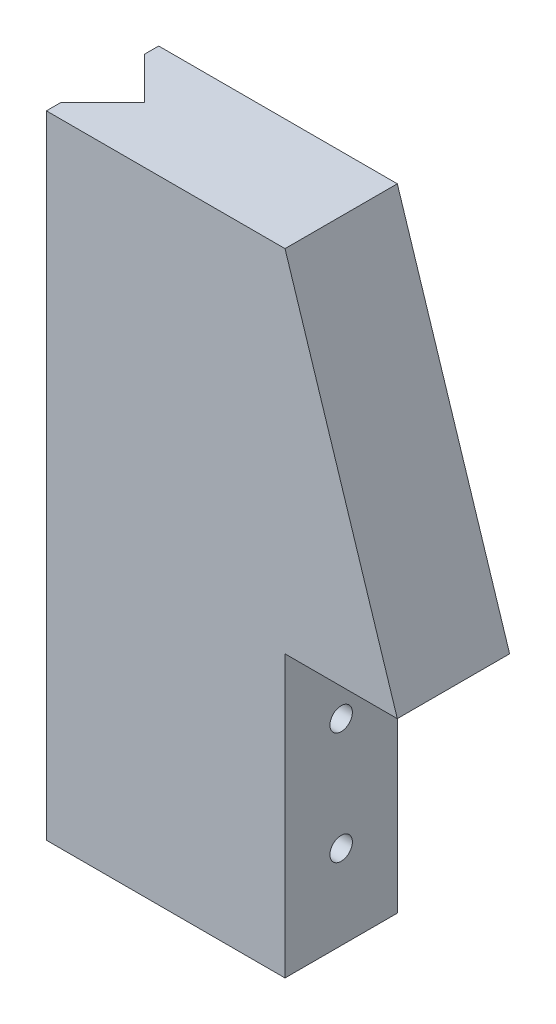
ISO-10303-21;
HEADER;
FILE_DESCRIPTION(('STEP AP214'),'2;1');
FILE_NAME('part.step','',(''),(''),'','','');
FILE_SCHEMA(('AUTOMOTIVE_DESIGN { 1 0 10303 214 1 1 1 1 }'));
ENDSEC;
DATA;
#1=APPLICATION_CONTEXT('core data for automotive mechanical design processes');
#2=APPLICATION_PROTOCOL_DEFINITION('international standard','automotive_design',2000,#1);
#3=PRODUCT_CONTEXT('',#1,'mechanical');
#4=PRODUCT('Part','Part','',(#3));
#5=PRODUCT_RELATED_PRODUCT_CATEGORY('part','',(#4));
#6=PRODUCT_DEFINITION_FORMATION('','',#4);
#7=PRODUCT_DEFINITION_CONTEXT('part definition',#1,'design');
#8=PRODUCT_DEFINITION('design','',#6,#7);
#9=PRODUCT_DEFINITION_SHAPE('','',#8);
#10=(LENGTH_UNIT() NAMED_UNIT(*) SI_UNIT(.MILLI.,.METRE.));
#11=(NAMED_UNIT(*) PLANE_ANGLE_UNIT() SI_UNIT($,.RADIAN.));
#12=(NAMED_UNIT(*) SI_UNIT($,.STERADIAN.) SOLID_ANGLE_UNIT());
#13=UNCERTAINTY_MEASURE_WITH_UNIT(LENGTH_MEASURE(1.E-05),#10,'distance_accuracy_value','');
#14=(GEOMETRIC_REPRESENTATION_CONTEXT(3) GLOBAL_UNCERTAINTY_ASSIGNED_CONTEXT((#13)) GLOBAL_UNIT_ASSIGNED_CONTEXT((#10,
#11,#12)) REPRESENTATION_CONTEXT('',''));
#15=CARTESIAN_POINT('',(0.,0.,0.));
#16=DIRECTION('',(0.,0.,1.));
#17=DIRECTION('',(1.,0.,0.));
#18=AXIS2_PLACEMENT_3D('',#15,#16,#17);
#19=CARTESIAN_POINT('',(-25.,-20.,8.));
#20=DIRECTION('',(1.,0.,0.));
#21=DIRECTION('',(0.,0.,-1.));
#22=AXIS2_PLACEMENT_3D('',#19,#20,#21);
#23=PLANE('',#22);
#24=DIRECTION('',(0.,0.,-1.));
#25=VECTOR('',#24,1.);
#26=CARTESIAN_POINT('',(-25.,-20.,8.));
#27=LINE('',#26,#25);
#28=CARTESIAN_POINT('',(-25.,-20.,1.));
#29=VERTEX_POINT('',#28);
#30=CARTESIAN_POINT('',(-25.,-20.,0.));
#31=VERTEX_POINT('',#30);
#32=EDGE_CURVE('E128',#29,#31,#27,.T.);
#33=ORIENTED_EDGE('',*,*,#32,.F.);
#34=DIRECTION('',(0.,1.,0.));
#35=VECTOR('',#34,1.);
#36=CARTESIAN_POINT('',(-25.,-20.,1.));
#37=LINE('',#36,#35);
#38=CARTESIAN_POINT('',(-25.,25.,1.));
#39=VERTEX_POINT('',#38);
#40=EDGE_CURVE('E141',#29,#39,#37,.T.);
#41=ORIENTED_EDGE('',*,*,#40,.T.);
#42=DIRECTION('',(0.,0.,-1.));
#43=VECTOR('',#42,1.);
#44=CARTESIAN_POINT('',(-25.,25.,8.));
#45=LINE('',#44,#43);
#46=CARTESIAN_POINT('',(-25.,25.,0.));
#47=VERTEX_POINT('',#46);
#48=EDGE_CURVE('E155',#39,#47,#45,.T.);
#49=ORIENTED_EDGE('',*,*,#48,.T.);
#50=DIRECTION('',(0.,-1.,0.));
#51=VECTOR('',#50,1.);
#52=CARTESIAN_POINT('',(-25.,-20.,0.));
#53=LINE('',#52,#51);
#54=EDGE_CURVE('E144',#47,#31,#53,.T.);
#55=ORIENTED_EDGE('',*,*,#54,.T.);
#56=EDGE_LOOP('',(#33,#41,#49,#55));
#57=FACE_BOUND('',#56,.T.);
#58=ADVANCED_FACE('F39',(#57),#23,.F.);
#59=CARTESIAN_POINT('',(-8.,25.,8.));
#60=DIRECTION('',(-0.952424147199324,-0.304775727103784,0.));
#61=DIRECTION('',(0.304775727103784,-0.952424147199324,0.));
#62=AXIS2_PLACEMENT_3D('',#59,#60,#61);
#63=PLANE('',#62);
#64=DIRECTION('',(-0.304775727103784,0.952424147199324,0.));
#65=VECTOR('',#64,1.);
#66=CARTESIAN_POINT('',(-8.,25.,0.));
#67=LINE('',#66,#65);
#68=CARTESIAN_POINT('',(0.,0.,0.));
#69=VERTEX_POINT('',#68);
#70=CARTESIAN_POINT('',(-8.,25.,0.));
#71=VERTEX_POINT('',#70);
#72=EDGE_CURVE('E137',#69,#71,#67,.T.);
#73=ORIENTED_EDGE('',*,*,#72,.T.);
#74=DIRECTION('',(0.,0.,-1.));
#75=VECTOR('',#74,1.);
#76=CARTESIAN_POINT('',(-8.,25.,8.));
#77=LINE('',#76,#75);
#78=CARTESIAN_POINT('',(-8.,25.,8.));
#79=VERTEX_POINT('',#78);
#80=EDGE_CURVE('E11',#79,#71,#77,.T.);
#81=ORIENTED_EDGE('',*,*,#80,.F.);
#82=DIRECTION('',(-0.304775727103784,0.952424147199324,0.));
#83=VECTOR('',#82,1.);
#84=CARTESIAN_POINT('',(-8.,25.,8.));
#85=LINE('',#84,#83);
#86=CARTESIAN_POINT('',(0.,0.,8.));
#87=VERTEX_POINT('',#86);
#88=EDGE_CURVE('E151',#87,#79,#85,.T.);
#89=ORIENTED_EDGE('',*,*,#88,.F.);
#90=DIRECTION('',(0.,0.,-1.));
#91=VECTOR('',#90,1.);
#92=CARTESIAN_POINT('',(0.,0.,8.));
#93=LINE('',#92,#91);
#94=EDGE_CURVE('E133',#87,#69,#93,.T.);
#95=ORIENTED_EDGE('',*,*,#94,.T.);
#96=EDGE_LOOP('',(#73,#81,#89,#95));
#97=FACE_BOUND('',#96,.T.);
#98=ADVANCED_FACE('F41',(#97),#63,.F.);
#99=CARTESIAN_POINT('',(-25.,25.,8.));
#100=DIRECTION('',(0.,-1.,0.));
#101=DIRECTION('',(1.,0.,0.));
#102=AXIS2_PLACEMENT_3D('',#99,#100,#101);
#103=PLANE('',#102);
#104=ORIENTED_EDGE('',*,*,#48,.F.);
#105=DIRECTION('',(-0.707106781186546,0.,-0.707106781186549));
#106=VECTOR('',#105,1.);
#107=CARTESIAN_POINT('',(-22.,25.,4.));
#108=LINE('',#107,#106);
#109=CARTESIAN_POINT('',(-22.,25.,4.));
#110=VERTEX_POINT('',#109);
#111=EDGE_CURVE('E183',#110,#39,#108,.T.);
#112=ORIENTED_EDGE('',*,*,#111,.F.);
#113=DIRECTION('',(0.707106781186546,0.,-0.707106781186549));
#114=VECTOR('',#113,1.);
#115=CARTESIAN_POINT('',(-25.,25.,7.));
#116=LINE('',#115,#114);
#117=CARTESIAN_POINT('',(-25.,25.,7.));
#118=VERTEX_POINT('',#117);
#119=EDGE_CURVE('E187',#118,#110,#116,.T.);
#120=ORIENTED_EDGE('',*,*,#119,.F.);
#121=CARTESIAN_POINT('',(-25.,25.,8.));
#122=VERTEX_POINT('',#121);
#123=EDGE_CURVE('E47',#122,#118,#45,.T.);
#124=ORIENTED_EDGE('',*,*,#123,.F.);
#125=DIRECTION('',(-1.,0.,0.));
#126=VECTOR('',#125,1.);
#127=CARTESIAN_POINT('',(-25.,25.,8.));
#128=LINE('',#127,#126);
#129=EDGE_CURVE('E98',#79,#122,#128,.T.);
#130=ORIENTED_EDGE('',*,*,#129,.F.);
#131=ORIENTED_EDGE('',*,*,#80,.T.);
#132=DIRECTION('',(-1.,0.,0.));
#133=VECTOR('',#132,1.);
#134=CARTESIAN_POINT('',(-25.,25.,0.));
#135=LINE('',#134,#133);
#136=EDGE_CURVE('E140',#71,#47,#135,.T.);
#137=ORIENTED_EDGE('',*,*,#136,.T.);
#138=EDGE_LOOP('',(#104,#112,#120,#124,#130,#131,#137));
#139=FACE_BOUND('',#138,.T.);
#140=ADVANCED_FACE('F166',(#139),#103,.F.);
#141=ORIENTED_EDGE('',*,*,#123,.T.);
#142=DIRECTION('',(0.,1.,0.));
#143=VECTOR('',#142,1.);
#144=CARTESIAN_POINT('',(-25.,-20.,7.));
#145=LINE('',#144,#143);
#146=CARTESIAN_POINT('',(-25.,-20.,7.));
#147=VERTEX_POINT('',#146);
#148=EDGE_CURVE('E177',#147,#118,#145,.T.);
#149=ORIENTED_EDGE('',*,*,#148,.F.);
#150=CARTESIAN_POINT('',(-25.,-20.,8.));
#151=VERTEX_POINT('',#150);
#152=EDGE_CURVE('E154',#151,#147,#27,.T.);
#153=ORIENTED_EDGE('',*,*,#152,.F.);
#154=DIRECTION('',(0.,-1.,0.));
#155=VECTOR('',#154,1.);
#156=CARTESIAN_POINT('',(-25.,-20.,8.));
#157=LINE('',#156,#155);
#158=EDGE_CURVE('E115',#122,#151,#157,.T.);
#159=ORIENTED_EDGE('',*,*,#158,.F.);
#160=EDGE_LOOP('',(#141,#149,#153,#159));
#161=FACE_BOUND('',#160,.T.);
#162=ADVANCED_FACE('F230',(#161),#23,.F.);
#163=CARTESIAN_POINT('',(-8.,-20.,8.));
#164=DIRECTION('',(0.,1.,0.));
#165=DIRECTION('',(0.,0.,1.));
#166=AXIS2_PLACEMENT_3D('',#163,#164,#165);
#167=PLANE('',#166);
#168=DIRECTION('',(0.707106781186546,0.,-0.707106781186549));
#169=VECTOR('',#168,1.);
#170=CARTESIAN_POINT('',(-25.,-20.,7.));
#171=LINE('',#170,#169);
#172=CARTESIAN_POINT('',(-22.,-20.,4.));
#173=VERTEX_POINT('',#172);
#174=EDGE_CURVE('E186',#147,#173,#171,.T.);
#175=ORIENTED_EDGE('',*,*,#174,.T.);
#176=DIRECTION('',(-0.707106781186546,0.,-0.707106781186549));
#177=VECTOR('',#176,1.);
#178=CARTESIAN_POINT('',(-22.,-20.,4.));
#179=LINE('',#178,#177);
#180=EDGE_CURVE('E54',#173,#29,#179,.T.);
#181=ORIENTED_EDGE('',*,*,#180,.T.);
#182=ORIENTED_EDGE('',*,*,#32,.T.);
#183=DIRECTION('',(1.,0.,0.));
#184=VECTOR('',#183,1.);
#185=CARTESIAN_POINT('',(-8.,-20.,0.));
#186=LINE('',#185,#184);
#187=CARTESIAN_POINT('',(-8.,-20.,0.));
#188=VERTEX_POINT('',#187);
#189=EDGE_CURVE('E125',#31,#188,#186,.T.);
#190=ORIENTED_EDGE('',*,*,#189,.T.);
#191=DIRECTION('',(0.,0.,-1.));
#192=VECTOR('',#191,1.);
#193=CARTESIAN_POINT('',(-8.,-20.,8.));
#194=LINE('',#193,#192);
#195=CARTESIAN_POINT('',(-8.,-20.,8.));
#196=VERTEX_POINT('',#195);
#197=EDGE_CURVE('E121',#196,#188,#194,.T.);
#198=ORIENTED_EDGE('',*,*,#197,.F.);
#199=DIRECTION('',(1.,0.,0.));
#200=VECTOR('',#199,1.);
#201=CARTESIAN_POINT('',(-8.,-20.,8.));
#202=LINE('',#201,#200);
#203=EDGE_CURVE('E108',#151,#196,#202,.T.);
#204=ORIENTED_EDGE('',*,*,#203,.F.);
#205=ORIENTED_EDGE('',*,*,#152,.T.);
#206=EDGE_LOOP('',(#175,#181,#182,#190,#198,#204,#205));
#207=FACE_BOUND('',#206,.T.);
#208=ADVANCED_FACE('F123',(#207),#167,.F.);
#209=CARTESIAN_POINT('',(-8.,0.,8.));
#210=DIRECTION('',(-1.,0.,0.));
#211=DIRECTION('',(0.,0.,1.));
#212=AXIS2_PLACEMENT_3D('',#209,#210,#211);
#213=PLANE('',#212);
#214=CARTESIAN_POINT('',(-8.,-6.,4.));
#215=DIRECTION('',(1.,0.,0.));
#216=DIRECTION('',(0.,0.,-1.));
#217=AXIS2_PLACEMENT_3D('',#214,#215,#216);
#218=CIRCLE('',#217,0.79999999999999);
#219=CARTESIAN_POINT('',(-8.,-6.,3.20000000000001));
#220=VERTEX_POINT('',#219);
#221=EDGE_CURVE('E201',#220,#220,#218,.T.);
#222=ORIENTED_EDGE('',*,*,#221,.F.);
#223=EDGE_LOOP('',(#222));
#224=FACE_BOUND('',#223,.T.);
#225=CARTESIAN_POINT('',(-8.,-14.,4.));
#226=DIRECTION('',(1.,0.,0.));
#227=DIRECTION('',(0.,0.,-1.));
#228=AXIS2_PLACEMENT_3D('',#225,#226,#227);
#229=CIRCLE('',#228,0.79999999999999);
#230=CARTESIAN_POINT('',(-8.,-14.,3.20000000000001));
#231=VERTEX_POINT('',#230);
#232=EDGE_CURVE('E195',#231,#231,#229,.T.);
#233=ORIENTED_EDGE('',*,*,#232,.F.);
#234=EDGE_LOOP('',(#233));
#235=FACE_BOUND('',#234,.T.);
#236=DIRECTION('',(0.,1.,0.));
#237=VECTOR('',#236,1.);
#238=CARTESIAN_POINT('',(-8.,0.,0.));
#239=LINE('',#238,#237);
#240=CARTESIAN_POINT('',(-8.,0.,0.));
#241=VERTEX_POINT('',#240);
#242=EDGE_CURVE('E148',#188,#241,#239,.T.);
#243=ORIENTED_EDGE('',*,*,#242,.T.);
#244=DIRECTION('',(0.,0.,-1.));
#245=VECTOR('',#244,1.);
#246=CARTESIAN_POINT('',(-8.,0.,8.));
#247=LINE('',#246,#245);
#248=CARTESIAN_POINT('',(-8.,0.,8.));
#249=VERTEX_POINT('',#248);
#250=EDGE_CURVE('E129',#249,#241,#247,.T.);
#251=ORIENTED_EDGE('',*,*,#250,.F.);
#252=DIRECTION('',(0.,1.,0.));
#253=VECTOR('',#252,1.);
#254=CARTESIAN_POINT('',(-8.,0.,8.));
#255=LINE('',#254,#253);
#256=EDGE_CURVE('E112',#196,#249,#255,.T.);
#257=ORIENTED_EDGE('',*,*,#256,.F.);
#258=ORIENTED_EDGE('',*,*,#197,.T.);
#259=EDGE_LOOP('',(#243,#251,#257,#258));
#260=FACE_BOUND('',#259,.T.);
#261=ADVANCED_FACE('F131',(#224,#235,#260),#213,.F.);
#262=CARTESIAN_POINT('',(0.,0.,8.));
#263=DIRECTION('',(0.,1.,0.));
#264=DIRECTION('',(0.,0.,1.));
#265=AXIS2_PLACEMENT_3D('',#262,#263,#264);
#266=PLANE('',#265);
#267=DIRECTION('',(1.,0.,0.));
#268=VECTOR('',#267,1.);
#269=CARTESIAN_POINT('',(0.,0.,0.));
#270=LINE('',#269,#268);
#271=EDGE_CURVE('E90',#241,#69,#270,.T.);
#272=ORIENTED_EDGE('',*,*,#271,.T.);
#273=ORIENTED_EDGE('',*,*,#94,.F.);
#274=DIRECTION('',(1.,0.,0.));
#275=VECTOR('',#274,1.);
#276=CARTESIAN_POINT('',(0.,0.,8.));
#277=LINE('',#276,#275);
#278=EDGE_CURVE('E63',#249,#87,#277,.T.);
#279=ORIENTED_EDGE('',*,*,#278,.F.);
#280=ORIENTED_EDGE('',*,*,#250,.T.);
#281=EDGE_LOOP('',(#272,#273,#279,#280));
#282=FACE_BOUND('',#281,.T.);
#283=ADVANCED_FACE('F171',(#282),#266,.F.);
#284=CARTESIAN_POINT('',(0.,0.,8.));
#285=DIRECTION('',(0.,0.,-1.));
#286=DIRECTION('',(-1.,0.,0.));
#287=AXIS2_PLACEMENT_3D('',#284,#285,#286);
#288=PLANE('',#287);
#289=ORIENTED_EDGE('',*,*,#88,.T.);
#290=ORIENTED_EDGE('',*,*,#129,.T.);
#291=ORIENTED_EDGE('',*,*,#158,.T.);
#292=ORIENTED_EDGE('',*,*,#203,.T.);
#293=ORIENTED_EDGE('',*,*,#256,.T.);
#294=ORIENTED_EDGE('',*,*,#278,.T.);
#295=EDGE_LOOP('',(#289,#290,#291,#292,#293,#294));
#296=FACE_BOUND('',#295,.T.);
#297=ADVANCED_FACE('F110',(#296),#288,.F.);
#298=CARTESIAN_POINT('',(0.,0.,0.));
#299=DIRECTION('',(0.,0.,-1.));
#300=DIRECTION('',(-1.,0.,0.));
#301=AXIS2_PLACEMENT_3D('',#298,#299,#300);
#302=PLANE('',#301);
#303=ORIENTED_EDGE('',*,*,#72,.F.);
#304=ORIENTED_EDGE('',*,*,#271,.F.);
#305=ORIENTED_EDGE('',*,*,#242,.F.);
#306=ORIENTED_EDGE('',*,*,#189,.F.);
#307=ORIENTED_EDGE('',*,*,#54,.F.);
#308=ORIENTED_EDGE('',*,*,#136,.F.);
#309=EDGE_LOOP('',(#303,#304,#305,#306,#307,#308));
#310=FACE_BOUND('',#309,.T.);
#311=ADVANCED_FACE('F170',(#310),#302,.T.);
#312=CARTESIAN_POINT('',(-22.,-20.,4.));
#313=DIRECTION('',(0.707106781186549,0.,-0.707106781186546));
#314=DIRECTION('',(-0.707106781186546,0.,-0.707106781186549));
#315=AXIS2_PLACEMENT_3D('',#312,#313,#314);
#316=PLANE('',#315);
#317=ORIENTED_EDGE('',*,*,#111,.T.);
#318=ORIENTED_EDGE('',*,*,#40,.F.);
#319=ORIENTED_EDGE('',*,*,#180,.F.);
#320=DIRECTION('',(0.,1.,0.));
#321=VECTOR('',#320,1.);
#322=CARTESIAN_POINT('',(-22.,-20.,4.));
#323=LINE('',#322,#321);
#324=EDGE_CURVE('E180',#173,#110,#323,.T.);
#325=ORIENTED_EDGE('',*,*,#324,.T.);
#326=EDGE_LOOP('',(#317,#318,#319,#325));
#327=FACE_BOUND('',#326,.T.);
#328=ADVANCED_FACE('F271',(#327),#316,.F.);
#329=CARTESIAN_POINT('',(-25.,-20.,7.));
#330=DIRECTION('',(0.707106781186549,0.,0.707106781186546));
#331=DIRECTION('',(0.707106781186546,0.,-0.707106781186549));
#332=AXIS2_PLACEMENT_3D('',#329,#330,#331);
#333=PLANE('',#332);
#334=ORIENTED_EDGE('',*,*,#119,.T.);
#335=ORIENTED_EDGE('',*,*,#324,.F.);
#336=ORIENTED_EDGE('',*,*,#174,.F.);
#337=ORIENTED_EDGE('',*,*,#148,.T.);
#338=EDGE_LOOP('',(#334,#335,#336,#337));
#339=FACE_BOUND('',#338,.T.);
#340=ADVANCED_FACE('F224',(#339),#333,.F.);
#341=CARTESIAN_POINT('',(-13.,-14.,4.));
#342=DIRECTION('',(1.,0.,0.));
#343=DIRECTION('',(0.,0.,-1.));
#344=AXIS2_PLACEMENT_3D('',#341,#342,#343);
#345=CONICAL_SURFACE('',#344,0.799999999999999,1.02974425867665);
#346=CARTESIAN_POINT('',(-13.480688495222,-14.,4.));
#347=VERTEX_POINT('',#346);
#348=VERTEX_LOOP('',#347);
#349=FACE_BOUND('',#348,.T.);
#350=CARTESIAN_POINT('',(-13.,-14.,4.));
#351=DIRECTION('',(1.,0.,0.));
#352=DIRECTION('',(0.,0.,-1.));
#353=AXIS2_PLACEMENT_3D('',#350,#351,#352);
#354=CIRCLE('',#353,0.799999999999999);
#355=CARTESIAN_POINT('',(-13.,-14.,3.2));
#356=VERTEX_POINT('',#355);
#357=EDGE_CURVE('E190',#356,#356,#354,.T.);
#358=ORIENTED_EDGE('',*,*,#357,.T.);
#359=EDGE_LOOP('',(#358));
#360=FACE_BOUND('',#359,.T.);
#361=ADVANCED_FACE('F215',(#349,#360),#345,.F.);
#362=CARTESIAN_POINT('',(-8.,-14.,4.));
#363=DIRECTION('',(1.,0.,0.));
#364=DIRECTION('',(0.,0.,-1.));
#365=AXIS2_PLACEMENT_3D('',#362,#363,#364);
#366=CYLINDRICAL_SURFACE('',#365,0.799999999999994);
#367=ORIENTED_EDGE('',*,*,#357,.F.);
#368=EDGE_LOOP('',(#367));
#369=FACE_BOUND('',#368,.T.);
#370=ORIENTED_EDGE('',*,*,#232,.T.);
#371=EDGE_LOOP('',(#370));
#372=FACE_BOUND('',#371,.T.);
#373=ADVANCED_FACE('F212',(#369,#372),#366,.F.);
#374=CARTESIAN_POINT('',(-13.,-6.,4.));
#375=DIRECTION('',(1.,0.,0.));
#376=DIRECTION('',(0.,0.,-1.));
#377=AXIS2_PLACEMENT_3D('',#374,#375,#376);
#378=CONICAL_SURFACE('',#377,0.799999999999999,1.02974425867665);
#379=CARTESIAN_POINT('',(-13.480688495222,-6.,4.));
#380=VERTEX_POINT('',#379);
#381=VERTEX_LOOP('',#380);
#382=FACE_BOUND('',#381,.T.);
#383=CARTESIAN_POINT('',(-13.,-6.,4.));
#384=DIRECTION('',(1.,0.,0.));
#385=DIRECTION('',(0.,0.,-1.));
#386=AXIS2_PLACEMENT_3D('',#383,#384,#385);
#387=CIRCLE('',#386,0.799999999999999);
#388=CARTESIAN_POINT('',(-13.,-6.,3.2));
#389=VERTEX_POINT('',#388);
#390=EDGE_CURVE('E198',#389,#389,#387,.T.);
#391=ORIENTED_EDGE('',*,*,#390,.T.);
#392=EDGE_LOOP('',(#391));
#393=FACE_BOUND('',#392,.T.);
#394=ADVANCED_FACE('F214',(#382,#393),#378,.F.);
#395=CARTESIAN_POINT('',(-8.,-6.,4.));
#396=DIRECTION('',(1.,0.,0.));
#397=DIRECTION('',(0.,0.,-1.));
#398=AXIS2_PLACEMENT_3D('',#395,#396,#397);
#399=CYLINDRICAL_SURFACE('',#398,0.799999999999994);
#400=ORIENTED_EDGE('',*,*,#390,.F.);
#401=EDGE_LOOP('',(#400));
#402=FACE_BOUND('',#401,.T.);
#403=ORIENTED_EDGE('',*,*,#221,.T.);
#404=EDGE_LOOP('',(#403));
#405=FACE_BOUND('',#404,.T.);
#406=ADVANCED_FACE('F205',(#402,#405),#399,.F.);
#407=CLOSED_SHELL('',(#58,#98,#140,#162,#208,#261,#283,#297,#311,#328,#340,#361,#373,#394,#406));
#408=MANIFOLD_SOLID_BREP('B2',#407);
#409=ADVANCED_BREP_SHAPE_REPRESENTATION('',(#18,#408),#14);
#410=SHAPE_DEFINITION_REPRESENTATION(#9,#409);
ENDSEC;
END-ISO-10303-21;
